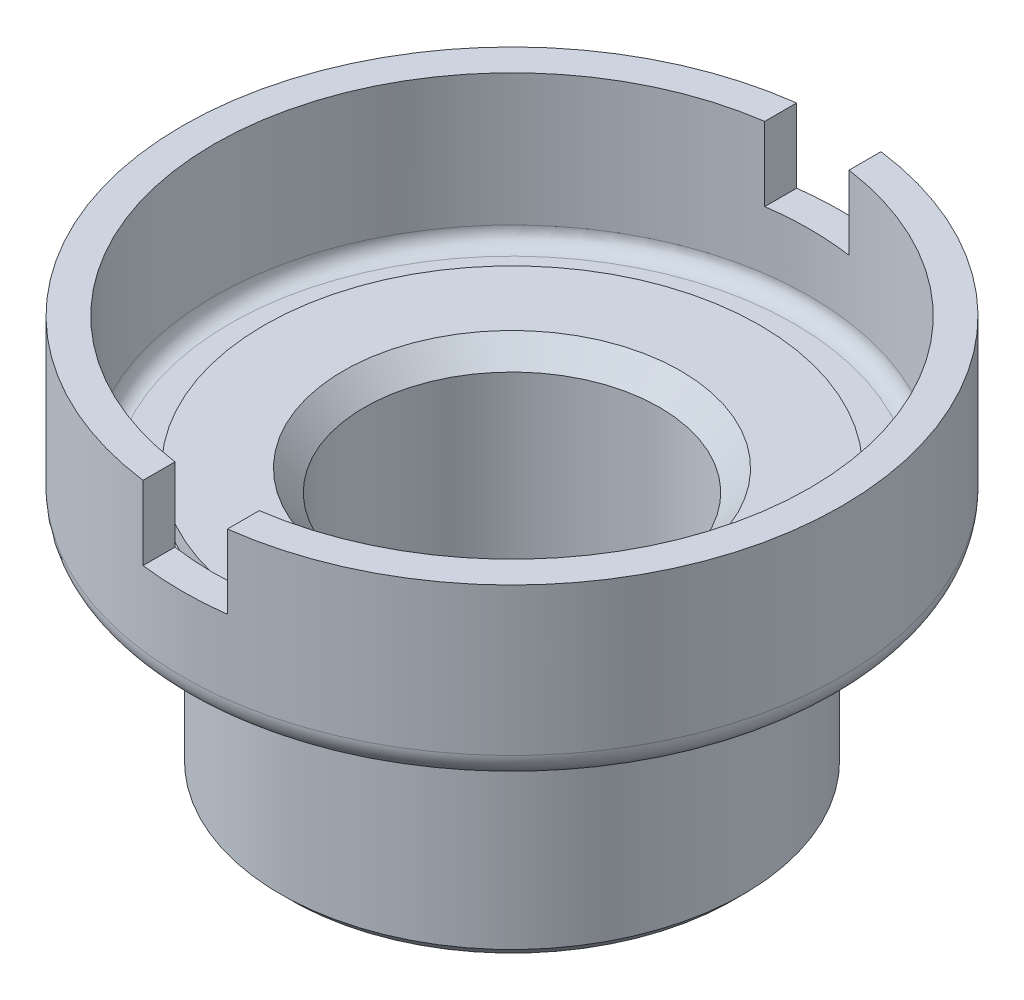
ISO-10303-21;
HEADER;
FILE_DESCRIPTION(('STEP AP214'),'2;1');
FILE_NAME('part.step','',(''),(''),'','','');
FILE_SCHEMA(('AUTOMOTIVE_DESIGN { 1 0 10303 214 1 1 1 1 }'));
ENDSEC;
DATA;
#1=APPLICATION_CONTEXT('core data for automotive mechanical design processes');
#2=APPLICATION_PROTOCOL_DEFINITION('international standard','automotive_design',2000,#1);
#3=PRODUCT_CONTEXT('',#1,'mechanical');
#4=PRODUCT('Part','Part','',(#3));
#5=PRODUCT_RELATED_PRODUCT_CATEGORY('part','',(#4));
#6=PRODUCT_DEFINITION_FORMATION('','',#4);
#7=PRODUCT_DEFINITION_CONTEXT('part definition',#1,'design');
#8=PRODUCT_DEFINITION('design','',#6,#7);
#9=PRODUCT_DEFINITION_SHAPE('','',#8);
#10=(LENGTH_UNIT() NAMED_UNIT(*) SI_UNIT(.MILLI.,.METRE.));
#11=(NAMED_UNIT(*) PLANE_ANGLE_UNIT() SI_UNIT($,.RADIAN.));
#12=(NAMED_UNIT(*) SI_UNIT($,.STERADIAN.) SOLID_ANGLE_UNIT());
#13=UNCERTAINTY_MEASURE_WITH_UNIT(LENGTH_MEASURE(1.E-05),#10,'distance_accuracy_value','');
#14=(GEOMETRIC_REPRESENTATION_CONTEXT(3) GLOBAL_UNCERTAINTY_ASSIGNED_CONTEXT((#13)) GLOBAL_UNIT_ASSIGNED_CONTEXT((#10,
#11,#12)) REPRESENTATION_CONTEXT('',''));
#15=CARTESIAN_POINT('',(0.,0.,0.));
#16=DIRECTION('',(0.,0.,1.));
#17=DIRECTION('',(1.,0.,0.));
#18=AXIS2_PLACEMENT_3D('',#15,#16,#17);
#19=CARTESIAN_POINT('',(-56.5,75.,0.));
#20=DIRECTION('',(0.,-1.,0.));
#21=DIRECTION('',(0.,0.,-1.));
#22=AXIS2_PLACEMENT_3D('',#19,#20,#21);
#23=PLANE('',#22);
#24=CARTESIAN_POINT('',(0.,75.,0.));
#25=DIRECTION('',(0.,-1.,0.));
#26=DIRECTION('',(0.,0.,-1.));
#27=AXIS2_PLACEMENT_3D('',#24,#25,#26);
#28=CIRCLE('',#27,62.5);
#29=CARTESIAN_POINT('',(-8.,75.,61.9858854901662));
#30=VERTEX_POINT('',#29);
#31=CARTESIAN_POINT('',(-8.,75.,-61.9858854901662));
#32=VERTEX_POINT('',#31);
#33=EDGE_CURVE('E124',#30,#32,#28,.T.);
#34=ORIENTED_EDGE('',*,*,#33,.F.);
#35=DIRECTION('',(0.,0.,1.));
#36=VECTOR('',#35,1.);
#37=CARTESIAN_POINT('',(-8.,75.,-110.5));
#38=LINE('',#37,#36);
#39=CARTESIAN_POINT('',(-8.,75.,55.93076076722));
#40=VERTEX_POINT('',#39);
#41=EDGE_CURVE('E207',#40,#30,#38,.T.);
#42=ORIENTED_EDGE('',*,*,#41,.F.);
#43=CARTESIAN_POINT('',(0.,75.,0.));
#44=DIRECTION('',(0.,-1.,0.));
#45=DIRECTION('',(0.,0.,-1.));
#46=AXIS2_PLACEMENT_3D('',#43,#44,#45);
#47=CIRCLE('',#46,56.5);
#48=CARTESIAN_POINT('',(-8.,75.,-55.93076076722));
#49=VERTEX_POINT('',#48);
#50=EDGE_CURVE('E152',#40,#49,#47,.T.);
#51=ORIENTED_EDGE('',*,*,#50,.T.);
#52=EDGE_CURVE('E107',#32,#49,#38,.T.);
#53=ORIENTED_EDGE('',*,*,#52,.F.);
#54=EDGE_LOOP('',(#34,#42,#51,#53));
#55=FACE_BOUND('',#54,.T.);
#56=ADVANCED_FACE('F35',(#55),#23,.F.);
#57=CARTESIAN_POINT('',(-41.94,0.,0.));
#58=DIRECTION('',(0.,1.,0.));
#59=DIRECTION('',(0.,0.,1.));
#60=AXIS2_PLACEMENT_3D('',#57,#58,#59);
#61=PLANE('',#60);
#62=CARTESIAN_POINT('',(0.,0.,0.));
#63=DIRECTION('',(0.,-1.,0.));
#64=DIRECTION('',(0.,0.,-1.));
#65=AXIS2_PLACEMENT_3D('',#62,#63,#64);
#66=CIRCLE('',#65,28.);
#67=CARTESIAN_POINT('',(0.,0.,-28.));
#68=VERTEX_POINT('',#67);
#69=EDGE_CURVE('E125',#68,#68,#66,.T.);
#70=ORIENTED_EDGE('',*,*,#69,.F.);
#71=EDGE_LOOP('',(#70));
#72=FACE_BOUND('',#71,.T.);
#73=CARTESIAN_POINT('',(0.,0.,0.));
#74=DIRECTION('',(0.,-1.,0.));
#75=DIRECTION('',(0.,0.,-1.));
#76=AXIS2_PLACEMENT_3D('',#73,#74,#75);
#77=CIRCLE('',#76,41.94);
#78=CARTESIAN_POINT('',(0.,0.,-41.94));
#79=VERTEX_POINT('',#78);
#80=EDGE_CURVE('E171',#79,#79,#77,.T.);
#81=ORIENTED_EDGE('',*,*,#80,.T.);
#82=EDGE_LOOP('',(#81));
#83=FACE_BOUND('',#82,.T.);
#84=ADVANCED_FACE('F37',(#72,#83),#61,.F.);
#85=CARTESIAN_POINT('',(0.,2.,0.));
#86=DIRECTION('',(0.,1.,0.));
#87=DIRECTION('',(0.,0.,1.));
#88=AXIS2_PLACEMENT_3D('',#85,#86,#87);
#89=CONICAL_SURFACE('',#88,43.94,0.785398163397447);
#90=ORIENTED_EDGE('',*,*,#80,.F.);
#91=EDGE_LOOP('',(#90));
#92=FACE_BOUND('',#91,.T.);
#93=CARTESIAN_POINT('',(0.,2.,0.));
#94=DIRECTION('',(0.,-1.,0.));
#95=DIRECTION('',(0.,0.,-1.));
#96=AXIS2_PLACEMENT_3D('',#93,#94,#95);
#97=CIRCLE('',#96,43.94);
#98=CARTESIAN_POINT('',(0.,2.,-43.94));
#99=VERTEX_POINT('',#98);
#100=EDGE_CURVE('E168',#99,#99,#97,.T.);
#101=ORIENTED_EDGE('',*,*,#100,.T.);
#102=EDGE_LOOP('',(#101));
#103=FACE_BOUND('',#102,.T.);
#104=ADVANCED_FACE('F216',(#92,#103),#89,.T.);
#105=CARTESIAN_POINT('',(0.,0.,0.));
#106=DIRECTION('',(0.,-1.,0.));
#107=DIRECTION('',(0.,0.,-1.));
#108=AXIS2_PLACEMENT_3D('',#105,#106,#107);
#109=CYLINDRICAL_SURFACE('',#108,43.94);
#110=ORIENTED_EDGE('',*,*,#100,.F.);
#111=EDGE_LOOP('',(#110));
#112=FACE_BOUND('',#111,.T.);
#113=CARTESIAN_POINT('',(0.,42.,0.));
#114=DIRECTION('',(0.,-1.,0.));
#115=DIRECTION('',(0.,0.,-1.));
#116=AXIS2_PLACEMENT_3D('',#113,#114,#115);
#117=CIRCLE('',#116,43.94);
#118=CARTESIAN_POINT('',(0.,42.,-43.94));
#119=VERTEX_POINT('',#118);
#120=EDGE_CURVE('E165',#119,#119,#117,.T.);
#121=ORIENTED_EDGE('',*,*,#120,.T.);
#122=EDGE_LOOP('',(#121));
#123=FACE_BOUND('',#122,.T.);
#124=ADVANCED_FACE('F236',(#112,#123),#109,.T.);
#125=CARTESIAN_POINT('',(-57.5,42.,0.));
#126=DIRECTION('',(0.,1.,0.));
#127=DIRECTION('',(0.,0.,1.));
#128=AXIS2_PLACEMENT_3D('',#125,#126,#127);
#129=PLANE('',#128);
#130=ORIENTED_EDGE('',*,*,#120,.F.);
#131=EDGE_LOOP('',(#130));
#132=FACE_BOUND('',#131,.T.);
#133=CARTESIAN_POINT('',(0.,42.,0.));
#134=DIRECTION('',(0.,-1.,0.));
#135=DIRECTION('',(0.,0.,-1.));
#136=AXIS2_PLACEMENT_3D('',#133,#134,#135);
#137=CIRCLE('',#136,57.5);
#138=CARTESIAN_POINT('',(0.,42.,-57.5));
#139=VERTEX_POINT('',#138);
#140=EDGE_CURVE('E162',#139,#139,#137,.T.);
#141=ORIENTED_EDGE('',*,*,#140,.T.);
#142=EDGE_LOOP('',(#141));
#143=FACE_BOUND('',#142,.T.);
#144=ADVANCED_FACE('F230',(#132,#143),#129,.F.);
#145=CARTESIAN_POINT('',(0.,47.,0.));
#146=DIRECTION('',(0.,-1.,0.));
#147=DIRECTION('',(0.,0.,-1.));
#148=AXIS2_PLACEMENT_3D('',#145,#146,#147);
#149=TOROIDAL_SURFACE('',#148,57.5,5.);
#150=ORIENTED_EDGE('',*,*,#140,.F.);
#151=EDGE_LOOP('',(#150));
#152=FACE_BOUND('',#151,.T.);
#153=CARTESIAN_POINT('',(0.,47.,0.));
#154=DIRECTION('',(0.,-1.,0.));
#155=DIRECTION('',(0.,0.,-1.));
#156=AXIS2_PLACEMENT_3D('',#153,#154,#155);
#157=CIRCLE('',#156,62.5);
#158=CARTESIAN_POINT('',(0.,47.,-62.5));
#159=VERTEX_POINT('',#158);
#160=EDGE_CURVE('E159',#159,#159,#157,.T.);
#161=ORIENTED_EDGE('',*,*,#160,.T.);
#162=EDGE_LOOP('',(#161));
#163=FACE_BOUND('',#162,.T.);
#164=ADVANCED_FACE('F226',(#152,#163),#149,.T.);
#165=CARTESIAN_POINT('',(0.,0.,0.));
#166=DIRECTION('',(0.,-1.,0.));
#167=DIRECTION('',(0.,0.,-1.));
#168=AXIS2_PLACEMENT_3D('',#165,#166,#167);
#169=CYLINDRICAL_SURFACE('',#168,62.5);
#170=CARTESIAN_POINT('',(0.,61.,0.));
#171=DIRECTION('',(0.,-1.,0.));
#172=DIRECTION('',(0.,0.,-1.));
#173=AXIS2_PLACEMENT_3D('',#170,#171,#172);
#174=CIRCLE('',#173,62.5);
#175=CARTESIAN_POINT('',(8.,61.,61.9858854901662));
#176=VERTEX_POINT('',#175);
#177=CARTESIAN_POINT('',(-8.,61.,61.9858854901662));
#178=VERTEX_POINT('',#177);
#179=EDGE_CURVE('E106',#176,#178,#174,.T.);
#180=ORIENTED_EDGE('',*,*,#179,.T.);
#181=DIRECTION('',(0.,-1.,0.));
#182=VECTOR('',#181,1.);
#183=CARTESIAN_POINT('',(-8.00000000000001,0.,61.9858854901662));
#184=LINE('',#183,#182);
#185=EDGE_CURVE('E126',#178,#30,#184,.F.);
#186=ORIENTED_EDGE('',*,*,#185,.T.);
#187=ORIENTED_EDGE('',*,*,#33,.T.);
#188=DIRECTION('',(0.,-1.,0.));
#189=VECTOR('',#188,1.);
#190=CARTESIAN_POINT('',(-8.00000000000001,0.,-61.9858854901662));
#191=LINE('',#190,#189);
#192=CARTESIAN_POINT('',(-8.,61.,-61.9858854901662));
#193=VERTEX_POINT('',#192);
#194=EDGE_CURVE('E111',#32,#193,#191,.T.);
#195=ORIENTED_EDGE('',*,*,#194,.T.);
#196=CARTESIAN_POINT('',(8.,61.,-61.9858854901662));
#197=VERTEX_POINT('',#196);
#198=EDGE_CURVE('E99',#193,#197,#174,.T.);
#199=ORIENTED_EDGE('',*,*,#198,.T.);
#200=DIRECTION('',(0.,-1.,0.));
#201=VECTOR('',#200,1.);
#202=CARTESIAN_POINT('',(8.00000000000001,0.,-61.9858854901662));
#203=LINE('',#202,#201);
#204=CARTESIAN_POINT('',(8.,75.,-61.9858854901662));
#205=VERTEX_POINT('',#204);
#206=EDGE_CURVE('E196',#197,#205,#203,.F.);
#207=ORIENTED_EDGE('',*,*,#206,.T.);
#208=CARTESIAN_POINT('',(8.,75.,61.9858854901662));
#209=VERTEX_POINT('',#208);
#210=EDGE_CURVE('E156',#205,#209,#28,.T.);
#211=ORIENTED_EDGE('',*,*,#210,.T.);
#212=DIRECTION('',(0.,-1.,0.));
#213=VECTOR('',#212,1.);
#214=CARTESIAN_POINT('',(8.00000000000001,0.,61.9858854901662));
#215=LINE('',#214,#213);
#216=EDGE_CURVE('E131',#209,#176,#215,.T.);
#217=ORIENTED_EDGE('',*,*,#216,.T.);
#218=EDGE_LOOP('',(#180,#186,#187,#195,#199,#207,#211,#217));
#219=FACE_BOUND('',#218,.T.);
#220=ORIENTED_EDGE('',*,*,#160,.F.);
#221=EDGE_LOOP('',(#220));
#222=FACE_BOUND('',#221,.T.);
#223=ADVANCED_FACE('F120',(#219,#222),#169,.T.);
#224=ORIENTED_EDGE('',*,*,#210,.F.);
#225=DIRECTION('',(0.,0.,1.));
#226=VECTOR('',#225,1.);
#227=CARTESIAN_POINT('',(8.,75.,-110.5));
#228=LINE('',#227,#226);
#229=CARTESIAN_POINT('',(8.,75.,-55.93076076722));
#230=VERTEX_POINT('',#229);
#231=EDGE_CURVE('E206',#205,#230,#228,.T.);
#232=ORIENTED_EDGE('',*,*,#231,.T.);
#233=CARTESIAN_POINT('',(8.,75.,55.93076076722));
#234=VERTEX_POINT('',#233);
#235=EDGE_CURVE('E153',#230,#234,#47,.T.);
#236=ORIENTED_EDGE('',*,*,#235,.T.);
#237=EDGE_CURVE('E202',#234,#209,#228,.T.);
#238=ORIENTED_EDGE('',*,*,#237,.T.);
#239=EDGE_LOOP('',(#224,#232,#236,#238));
#240=FACE_BOUND('',#239,.T.);
#241=ADVANCED_FACE('F204',(#240),#23,.F.);
#242=CARTESIAN_POINT('',(0.,0.,0.));
#243=DIRECTION('',(0.,-1.,0.));
#244=DIRECTION('',(0.,0.,-1.));
#245=AXIS2_PLACEMENT_3D('',#242,#243,#244);
#246=CYLINDRICAL_SURFACE('',#245,56.5);
#247=ORIENTED_EDGE('',*,*,#50,.F.);
#248=DIRECTION('',(0.,-1.,0.));
#249=VECTOR('',#248,1.);
#250=CARTESIAN_POINT('',(-8.00000000000001,0.,55.93076076722));
#251=LINE('',#250,#249);
#252=CARTESIAN_POINT('',(-8.,61.,55.93076076722));
#253=VERTEX_POINT('',#252);
#254=EDGE_CURVE('E11',#40,#253,#251,.T.);
#255=ORIENTED_EDGE('',*,*,#254,.T.);
#256=CARTESIAN_POINT('',(0.,61.,0.));
#257=DIRECTION('',(0.,-1.,0.));
#258=DIRECTION('',(0.,0.,-1.));
#259=AXIS2_PLACEMENT_3D('',#256,#257,#258);
#260=CIRCLE('',#259,56.5);
#261=CARTESIAN_POINT('',(8.,61.,55.93076076722));
#262=VERTEX_POINT('',#261);
#263=EDGE_CURVE('E177',#253,#262,#260,.F.);
#264=ORIENTED_EDGE('',*,*,#263,.T.);
#265=DIRECTION('',(0.,-1.,0.));
#266=VECTOR('',#265,1.);
#267=CARTESIAN_POINT('',(8.00000000000001,0.,55.93076076722));
#268=LINE('',#267,#266);
#269=EDGE_CURVE('E43',#262,#234,#268,.F.);
#270=ORIENTED_EDGE('',*,*,#269,.T.);
#271=ORIENTED_EDGE('',*,*,#235,.F.);
#272=DIRECTION('',(0.,-1.,0.));
#273=VECTOR('',#272,1.);
#274=CARTESIAN_POINT('',(8.00000000000001,0.,-55.93076076722));
#275=LINE('',#274,#273);
#276=CARTESIAN_POINT('',(8.,61.,-55.93076076722));
#277=VERTEX_POINT('',#276);
#278=EDGE_CURVE('E176',#230,#277,#275,.T.);
#279=ORIENTED_EDGE('',*,*,#278,.T.);
#280=CARTESIAN_POINT('',(-8.,61.,-55.93076076722));
#281=VERTEX_POINT('',#280);
#282=EDGE_CURVE('E174',#277,#281,#260,.F.);
#283=ORIENTED_EDGE('',*,*,#282,.T.);
#284=DIRECTION('',(0.,-1.,0.));
#285=VECTOR('',#284,1.);
#286=CARTESIAN_POINT('',(-8.00000000000001,0.,-55.93076076722));
#287=LINE('',#286,#285);
#288=EDGE_CURVE('E114',#281,#49,#287,.F.);
#289=ORIENTED_EDGE('',*,*,#288,.T.);
#290=EDGE_LOOP('',(#247,#255,#264,#270,#271,#279,#283,#289));
#291=FACE_BOUND('',#290,.T.);
#292=CARTESIAN_POINT('',(0.,50.,0.));
#293=DIRECTION('',(0.,-1.,0.));
#294=DIRECTION('',(0.,0.,-1.));
#295=AXIS2_PLACEMENT_3D('',#292,#293,#294);
#296=CIRCLE('',#295,56.5);
#297=CARTESIAN_POINT('',(0.,50.,-56.5));
#298=VERTEX_POINT('',#297);
#299=EDGE_CURVE('E149',#298,#298,#296,.T.);
#300=ORIENTED_EDGE('',*,*,#299,.T.);
#301=EDGE_LOOP('',(#300));
#302=FACE_BOUND('',#301,.T.);
#303=ADVANCED_FACE('F185',(#291,#302),#246,.F.);
#304=CARTESIAN_POINT('',(0.,50.,0.));
#305=DIRECTION('',(0.,-1.,0.));
#306=DIRECTION('',(0.,0.,-1.));
#307=AXIS2_PLACEMENT_3D('',#304,#305,#306);
#308=TOROIDAL_SURFACE('',#307,53.5,3.);
#309=ORIENTED_EDGE('',*,*,#299,.F.);
#310=EDGE_LOOP('',(#309));
#311=FACE_BOUND('',#310,.T.);
#312=CARTESIAN_POINT('',(0.,47.,0.));
#313=DIRECTION('',(0.,-1.,0.));
#314=DIRECTION('',(0.,0.,-1.));
#315=AXIS2_PLACEMENT_3D('',#312,#313,#314);
#316=CIRCLE('',#315,53.5);
#317=CARTESIAN_POINT('',(0.,47.,-53.5));
#318=VERTEX_POINT('',#317);
#319=EDGE_CURVE('E146',#318,#318,#316,.T.);
#320=ORIENTED_EDGE('',*,*,#319,.T.);
#321=EDGE_LOOP('',(#320));
#322=FACE_BOUND('',#321,.T.);
#323=ADVANCED_FACE('F225',(#311,#322),#308,.F.);
#324=CARTESIAN_POINT('',(-47.,47.,0.));
#325=DIRECTION('',(0.,-1.,0.));
#326=DIRECTION('',(0.,0.,-1.));
#327=AXIS2_PLACEMENT_3D('',#324,#325,#326);
#328=PLANE('',#327);
#329=ORIENTED_EDGE('',*,*,#319,.F.);
#330=EDGE_LOOP('',(#329));
#331=FACE_BOUND('',#330,.T.);
#332=CARTESIAN_POINT('',(0.,47.,0.));
#333=DIRECTION('',(0.,-1.,0.));
#334=DIRECTION('',(0.,0.,-1.));
#335=AXIS2_PLACEMENT_3D('',#332,#333,#334);
#336=CIRCLE('',#335,47.);
#337=CARTESIAN_POINT('',(0.,47.,-47.));
#338=VERTEX_POINT('',#337);
#339=EDGE_CURVE('E143',#338,#338,#336,.T.);
#340=ORIENTED_EDGE('',*,*,#339,.T.);
#341=EDGE_LOOP('',(#340));
#342=FACE_BOUND('',#341,.T.);
#343=ADVANCED_FACE('F278',(#331,#342),#328,.F.);
#344=CARTESIAN_POINT('',(0.,0.,0.));
#345=DIRECTION('',(0.,-1.,0.));
#346=DIRECTION('',(0.,0.,-1.));
#347=AXIS2_PLACEMENT_3D('',#344,#345,#346);
#348=CYLINDRICAL_SURFACE('',#347,47.);
#349=ORIENTED_EDGE('',*,*,#339,.F.);
#350=EDGE_LOOP('',(#349));
#351=FACE_BOUND('',#350,.T.);
#352=CARTESIAN_POINT('',(0.,50.,0.));
#353=DIRECTION('',(0.,-1.,0.));
#354=DIRECTION('',(0.,0.,-1.));
#355=AXIS2_PLACEMENT_3D('',#352,#353,#354);
#356=CIRCLE('',#355,47.);
#357=CARTESIAN_POINT('',(0.,50.,-47.));
#358=VERTEX_POINT('',#357);
#359=EDGE_CURVE('E140',#358,#358,#356,.T.);
#360=ORIENTED_EDGE('',*,*,#359,.T.);
#361=EDGE_LOOP('',(#360));
#362=FACE_BOUND('',#361,.T.);
#363=ADVANCED_FACE('F289',(#351,#362),#348,.T.);
#364=CARTESIAN_POINT('',(-32.,50.,0.));
#365=DIRECTION('',(0.,-1.,0.));
#366=DIRECTION('',(0.,0.,-1.));
#367=AXIS2_PLACEMENT_3D('',#364,#365,#366);
#368=PLANE('',#367);
#369=ORIENTED_EDGE('',*,*,#359,.F.);
#370=EDGE_LOOP('',(#369));
#371=FACE_BOUND('',#370,.T.);
#372=CARTESIAN_POINT('',(0.,50.,0.));
#373=DIRECTION('',(0.,-1.,0.));
#374=DIRECTION('',(0.,0.,-1.));
#375=AXIS2_PLACEMENT_3D('',#372,#373,#374);
#376=CIRCLE('',#375,32.);
#377=CARTESIAN_POINT('',(0.,50.,-32.));
#378=VERTEX_POINT('',#377);
#379=EDGE_CURVE('E137',#378,#378,#376,.T.);
#380=ORIENTED_EDGE('',*,*,#379,.T.);
#381=EDGE_LOOP('',(#380));
#382=FACE_BOUND('',#381,.T.);
#383=ADVANCED_FACE('F299',(#371,#382),#368,.F.);
#384=CARTESIAN_POINT('',(0.,46.,0.));
#385=DIRECTION('',(0.,1.,0.));
#386=DIRECTION('',(0.,0.,1.));
#387=AXIS2_PLACEMENT_3D('',#384,#385,#386);
#388=CONICAL_SURFACE('',#387,28.,0.785398163397447);
#389=ORIENTED_EDGE('',*,*,#379,.F.);
#390=EDGE_LOOP('',(#389));
#391=FACE_BOUND('',#390,.T.);
#392=CARTESIAN_POINT('',(0.,46.,0.));
#393=DIRECTION('',(0.,-1.,0.));
#394=DIRECTION('',(0.,0.,-1.));
#395=AXIS2_PLACEMENT_3D('',#392,#393,#394);
#396=CIRCLE('',#395,28.);
#397=CARTESIAN_POINT('',(0.,46.,-28.));
#398=VERTEX_POINT('',#397);
#399=EDGE_CURVE('E129',#398,#398,#396,.T.);
#400=ORIENTED_EDGE('',*,*,#399,.T.);
#401=EDGE_LOOP('',(#400));
#402=FACE_BOUND('',#401,.T.);
#403=ADVANCED_FACE('F309',(#391,#402),#388,.F.);
#404=CARTESIAN_POINT('',(0.,0.,0.));
#405=DIRECTION('',(0.,-1.,0.));
#406=DIRECTION('',(0.,0.,-1.));
#407=AXIS2_PLACEMENT_3D('',#404,#405,#406);
#408=CYLINDRICAL_SURFACE('',#407,28.);
#409=ORIENTED_EDGE('',*,*,#399,.F.);
#410=EDGE_LOOP('',(#409));
#411=FACE_BOUND('',#410,.T.);
#412=ORIENTED_EDGE('',*,*,#69,.T.);
#413=EDGE_LOOP('',(#412));
#414=FACE_BOUND('',#413,.T.);
#415=ADVANCED_FACE('F319',(#411,#414),#408,.F.);
#416=CARTESIAN_POINT('',(-8.,61.,-110.5));
#417=DIRECTION('',(0.,-1.,0.));
#418=DIRECTION('',(0.,0.,-1.));
#419=AXIS2_PLACEMENT_3D('',#416,#417,#418);
#420=PLANE('',#419);
#421=DIRECTION('',(0.,0.,1.));
#422=VECTOR('',#421,1.);
#423=CARTESIAN_POINT('',(-8.,61.,-110.5));
#424=LINE('',#423,#422);
#425=EDGE_CURVE('E58',#193,#281,#424,.T.);
#426=ORIENTED_EDGE('',*,*,#425,.T.);
#427=ORIENTED_EDGE('',*,*,#282,.F.);
#428=DIRECTION('',(0.,0.,1.));
#429=VECTOR('',#428,1.);
#430=CARTESIAN_POINT('',(8.,61.,-110.5));
#431=LINE('',#430,#429);
#432=EDGE_CURVE('E102',#197,#277,#431,.T.);
#433=ORIENTED_EDGE('',*,*,#432,.F.);
#434=ORIENTED_EDGE('',*,*,#198,.F.);
#435=EDGE_LOOP('',(#426,#427,#433,#434));
#436=FACE_BOUND('',#435,.T.);
#437=ADVANCED_FACE('F100',(#436),#420,.F.);
#438=CARTESIAN_POINT('',(8.,75.,-110.5));
#439=DIRECTION('',(1.,0.,0.));
#440=DIRECTION('',(0.,1.,0.));
#441=AXIS2_PLACEMENT_3D('',#438,#439,#440);
#442=PLANE('',#441);
#443=ORIENTED_EDGE('',*,*,#432,.T.);
#444=ORIENTED_EDGE('',*,*,#278,.F.);
#445=ORIENTED_EDGE('',*,*,#231,.F.);
#446=ORIENTED_EDGE('',*,*,#206,.F.);
#447=EDGE_LOOP('',(#443,#444,#445,#446));
#448=FACE_BOUND('',#447,.T.);
#449=ADVANCED_FACE('F354',(#448),#442,.F.);
#450=CARTESIAN_POINT('',(-8.,75.,-110.5));
#451=DIRECTION('',(-1.,0.,0.));
#452=DIRECTION('',(0.,-1.,0.));
#453=AXIS2_PLACEMENT_3D('',#450,#451,#452);
#454=PLANE('',#453);
#455=ORIENTED_EDGE('',*,*,#52,.T.);
#456=ORIENTED_EDGE('',*,*,#288,.F.);
#457=ORIENTED_EDGE('',*,*,#425,.F.);
#458=ORIENTED_EDGE('',*,*,#194,.F.);
#459=EDGE_LOOP('',(#455,#456,#457,#458));
#460=FACE_BOUND('',#459,.T.);
#461=ADVANCED_FACE('F110',(#460),#454,.F.);
#462=EDGE_CURVE('E116',#253,#178,#424,.T.);
#463=ORIENTED_EDGE('',*,*,#462,.F.);
#464=ORIENTED_EDGE('',*,*,#254,.F.);
#465=ORIENTED_EDGE('',*,*,#41,.T.);
#466=ORIENTED_EDGE('',*,*,#185,.F.);
#467=EDGE_LOOP('',(#463,#464,#465,#466));
#468=FACE_BOUND('',#467,.T.);
#469=ADVANCED_FACE('F191',(#468),#454,.F.);
#470=ORIENTED_EDGE('',*,*,#237,.F.);
#471=ORIENTED_EDGE('',*,*,#269,.F.);
#472=EDGE_CURVE('E50',#262,#176,#431,.T.);
#473=ORIENTED_EDGE('',*,*,#472,.T.);
#474=ORIENTED_EDGE('',*,*,#216,.F.);
#475=EDGE_LOOP('',(#470,#471,#473,#474));
#476=FACE_BOUND('',#475,.T.);
#477=ADVANCED_FACE('F201',(#476),#442,.F.);
#478=ORIENTED_EDGE('',*,*,#472,.F.);
#479=ORIENTED_EDGE('',*,*,#263,.F.);
#480=ORIENTED_EDGE('',*,*,#462,.T.);
#481=ORIENTED_EDGE('',*,*,#179,.F.);
#482=EDGE_LOOP('',(#478,#479,#480,#481));
#483=FACE_BOUND('',#482,.T.);
#484=ADVANCED_FACE('F189',(#483),#420,.F.);
#485=CLOSED_SHELL('',(#56,#84,#104,#124,#144,#164,#223,#241,#303,#323,#343,#363,#383,#403,#415,
#437,#449,#461,#469,#477,#484));
#486=MANIFOLD_SOLID_BREP('B2',#485);
#487=ADVANCED_BREP_SHAPE_REPRESENTATION('',(#18,#486),#14);
#488=SHAPE_DEFINITION_REPRESENTATION(#9,#487);
ENDSEC;
END-ISO-10303-21;
